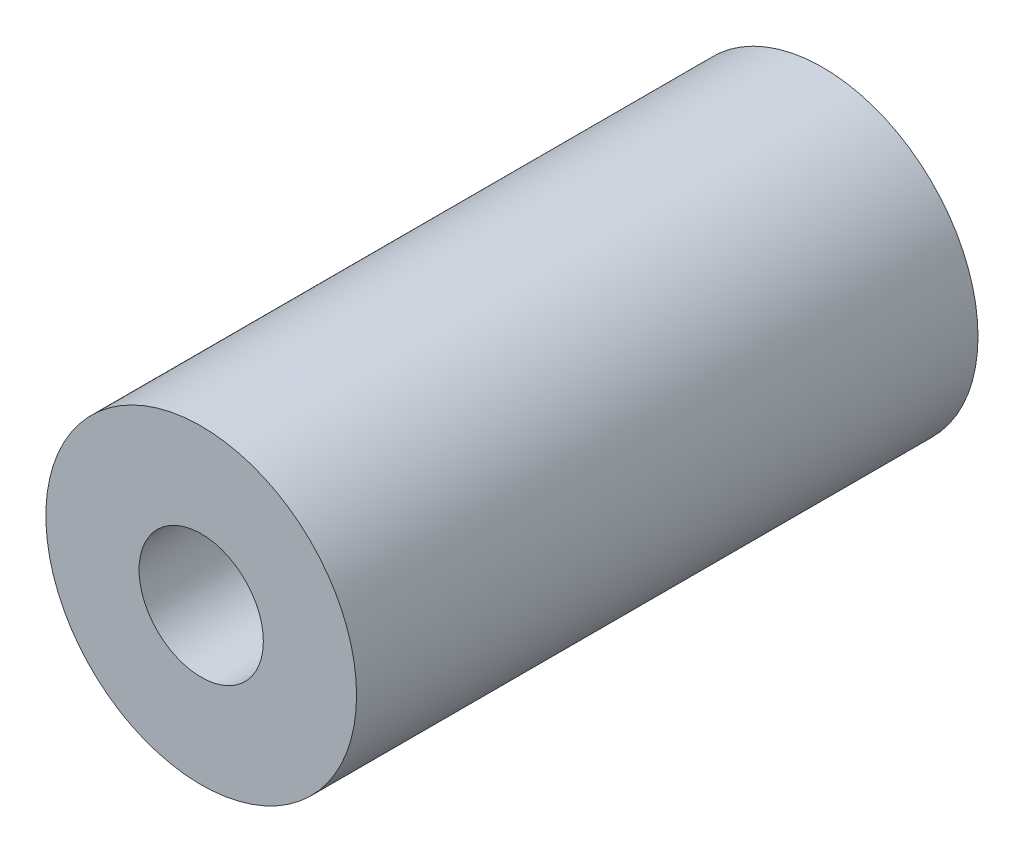
ISO-10303-21;
HEADER;
FILE_DESCRIPTION(('STEP AP214'),'2;1');
FILE_NAME('part.step','',(''),(''),'','','');
FILE_SCHEMA(('AUTOMOTIVE_DESIGN { 1 0 10303 214 1 1 1 1 }'));
ENDSEC;
DATA;
#1=APPLICATION_CONTEXT('core data for automotive mechanical design processes');
#2=APPLICATION_PROTOCOL_DEFINITION('international standard','automotive_design',2000,#1);
#3=PRODUCT_CONTEXT('',#1,'mechanical');
#4=PRODUCT('Part','Part','',(#3));
#5=PRODUCT_RELATED_PRODUCT_CATEGORY('part','',(#4));
#6=PRODUCT_DEFINITION_FORMATION('','',#4);
#7=PRODUCT_DEFINITION_CONTEXT('part definition',#1,'design');
#8=PRODUCT_DEFINITION('design','',#6,#7);
#9=PRODUCT_DEFINITION_SHAPE('','',#8);
#10=(LENGTH_UNIT() NAMED_UNIT(*) SI_UNIT(.MILLI.,.METRE.));
#11=(NAMED_UNIT(*) PLANE_ANGLE_UNIT() SI_UNIT($,.RADIAN.));
#12=(NAMED_UNIT(*) SI_UNIT($,.STERADIAN.) SOLID_ANGLE_UNIT());
#13=UNCERTAINTY_MEASURE_WITH_UNIT(LENGTH_MEASURE(1.E-05),#10,'distance_accuracy_value','');
#14=(GEOMETRIC_REPRESENTATION_CONTEXT(3) GLOBAL_UNCERTAINTY_ASSIGNED_CONTEXT((#13)) GLOBAL_UNIT_ASSIGNED_CONTEXT((#10,
#11,#12)) REPRESENTATION_CONTEXT('',''));
#15=CARTESIAN_POINT('',(0.,0.,0.));
#16=DIRECTION('',(0.,0.,1.));
#17=DIRECTION('',(1.,0.,0.));
#18=AXIS2_PLACEMENT_3D('',#15,#16,#17);
#19=CARTESIAN_POINT('',(0.,0.,10.));
#20=DIRECTION('',(0.,0.,-1.));
#21=DIRECTION('',(-1.,0.,0.));
#22=AXIS2_PLACEMENT_3D('',#19,#20,#21);
#23=CYLINDRICAL_SURFACE('',#22,1.);
#24=CARTESIAN_POINT('',(0.,0.,10.));
#25=DIRECTION('',(0.,0.,1.));
#26=DIRECTION('',(1.,0.,0.));
#27=AXIS2_PLACEMENT_3D('',#24,#25,#26);
#28=CIRCLE('',#27,1.);
#29=CARTESIAN_POINT('',(1.,0.,10.));
#30=VERTEX_POINT('',#29);
#31=EDGE_CURVE('E46',#30,#30,#28,.T.);
#32=ORIENTED_EDGE('',*,*,#31,.T.);
#33=EDGE_LOOP('',(#32));
#34=FACE_BOUND('',#33,.T.);
#35=CARTESIAN_POINT('',(0.,0.,0.));
#36=DIRECTION('',(0.,0.,1.));
#37=DIRECTION('',(1.,0.,0.));
#38=AXIS2_PLACEMENT_3D('',#35,#36,#37);
#39=CIRCLE('',#38,1.);
#40=CARTESIAN_POINT('',(1.,0.,0.));
#41=VERTEX_POINT('',#40);
#42=EDGE_CURVE('E52',#41,#41,#39,.T.);
#43=ORIENTED_EDGE('',*,*,#42,.F.);
#44=EDGE_LOOP('',(#43));
#45=FACE_BOUND('',#44,.T.);
#46=ADVANCED_FACE('F39',(#34,#45),#23,.F.);
#47=CARTESIAN_POINT('',(0.,0.,10.));
#48=DIRECTION('',(0.,0.,-1.));
#49=DIRECTION('',(-1.,0.,0.));
#50=AXIS2_PLACEMENT_3D('',#47,#48,#49);
#51=CYLINDRICAL_SURFACE('',#50,2.5);
#52=CARTESIAN_POINT('',(0.,0.,10.));
#53=DIRECTION('',(0.,0.,1.));
#54=DIRECTION('',(1.,0.,0.));
#55=AXIS2_PLACEMENT_3D('',#52,#53,#54);
#56=CIRCLE('',#55,2.5);
#57=CARTESIAN_POINT('',(2.5,0.,10.));
#58=VERTEX_POINT('',#57);
#59=EDGE_CURVE('E10',#58,#58,#56,.T.);
#60=ORIENTED_EDGE('',*,*,#59,.F.);
#61=EDGE_LOOP('',(#60));
#62=FACE_BOUND('',#61,.T.);
#63=CARTESIAN_POINT('',(0.,0.,0.));
#64=DIRECTION('',(0.,0.,1.));
#65=DIRECTION('',(1.,0.,0.));
#66=AXIS2_PLACEMENT_3D('',#63,#64,#65);
#67=CIRCLE('',#66,2.5);
#68=CARTESIAN_POINT('',(2.5,0.,0.));
#69=VERTEX_POINT('',#68);
#70=EDGE_CURVE('E42',#69,#69,#67,.T.);
#71=ORIENTED_EDGE('',*,*,#70,.T.);
#72=EDGE_LOOP('',(#71));
#73=FACE_BOUND('',#72,.T.);
#74=ADVANCED_FACE('F59',(#62,#73),#51,.T.);
#75=CARTESIAN_POINT('',(0.,0.,10.));
#76=DIRECTION('',(0.,0.,1.));
#77=DIRECTION('',(1.,0.,0.));
#78=AXIS2_PLACEMENT_3D('',#75,#76,#77);
#79=PLANE('',#78);
#80=ORIENTED_EDGE('',*,*,#31,.F.);
#81=EDGE_LOOP('',(#80));
#82=FACE_BOUND('',#81,.T.);
#83=ORIENTED_EDGE('',*,*,#59,.T.);
#84=EDGE_LOOP('',(#83));
#85=FACE_BOUND('',#84,.T.);
#86=ADVANCED_FACE('F63',(#82,#85),#79,.T.);
#87=CARTESIAN_POINT('',(0.,0.,0.));
#88=DIRECTION('',(0.,0.,1.));
#89=DIRECTION('',(1.,0.,0.));
#90=AXIS2_PLACEMENT_3D('',#87,#88,#89);
#91=PLANE('',#90);
#92=ORIENTED_EDGE('',*,*,#42,.T.);
#93=EDGE_LOOP('',(#92));
#94=FACE_BOUND('',#93,.T.);
#95=ORIENTED_EDGE('',*,*,#70,.F.);
#96=EDGE_LOOP('',(#95));
#97=FACE_BOUND('',#96,.T.);
#98=ADVANCED_FACE('F61',(#94,#97),#91,.F.);
#99=CLOSED_SHELL('',(#46,#74,#86,#98));
#100=MANIFOLD_SOLID_BREP('B2',#99);
#101=ADVANCED_BREP_SHAPE_REPRESENTATION('',(#18,#100),#14);
#102=SHAPE_DEFINITION_REPRESENTATION(#9,#101);
ENDSEC;
END-ISO-10303-21;
